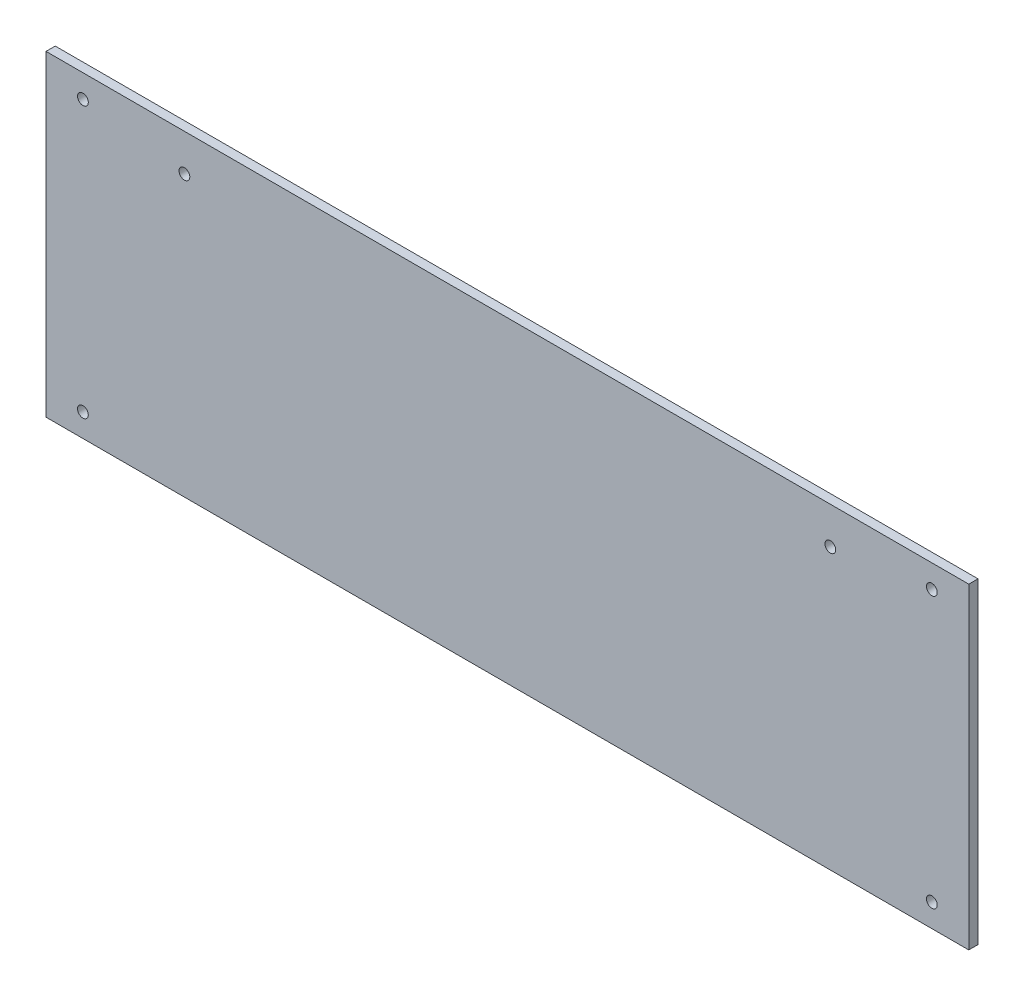
ISO-10303-21;
HEADER;
FILE_DESCRIPTION(('STEP AP214'),'2;1');
FILE_NAME('part.step','',(''),(''),'','','');
FILE_SCHEMA(('AUTOMOTIVE_DESIGN { 1 0 10303 214 1 1 1 1 }'));
ENDSEC;
DATA;
#1=APPLICATION_CONTEXT('core data for automotive mechanical design processes');
#2=APPLICATION_PROTOCOL_DEFINITION('international standard','automotive_design',2000,#1);
#3=PRODUCT_CONTEXT('',#1,'mechanical');
#4=PRODUCT('Part','Part','',(#3));
#5=PRODUCT_RELATED_PRODUCT_CATEGORY('part','',(#4));
#6=PRODUCT_DEFINITION_FORMATION('','',#4);
#7=PRODUCT_DEFINITION_CONTEXT('part definition',#1,'design');
#8=PRODUCT_DEFINITION('design','',#6,#7);
#9=PRODUCT_DEFINITION_SHAPE('','',#8);
#10=(LENGTH_UNIT() NAMED_UNIT(*) SI_UNIT(.MILLI.,.METRE.));
#11=(NAMED_UNIT(*) PLANE_ANGLE_UNIT() SI_UNIT($,.RADIAN.));
#12=(NAMED_UNIT(*) SI_UNIT($,.STERADIAN.) SOLID_ANGLE_UNIT());
#13=UNCERTAINTY_MEASURE_WITH_UNIT(LENGTH_MEASURE(1.E-05),#10,'distance_accuracy_value','');
#14=(GEOMETRIC_REPRESENTATION_CONTEXT(3) GLOBAL_UNCERTAINTY_ASSIGNED_CONTEXT((#13)) GLOBAL_UNIT_ASSIGNED_CONTEXT((#10,
#11,#12)) REPRESENTATION_CONTEXT('',''));
#15=CARTESIAN_POINT('',(0.,0.,0.));
#16=DIRECTION('',(0.,0.,1.));
#17=DIRECTION('',(1.,0.,0.));
#18=AXIS2_PLACEMENT_3D('',#15,#16,#17);
#19=CARTESIAN_POINT('',(0.,0.,3.));
#20=DIRECTION('',(0.,0.,-1.));
#21=DIRECTION('',(-1.,0.,0.));
#22=AXIS2_PLACEMENT_3D('',#19,#20,#21);
#23=PLANE('',#22);
#24=DIRECTION('',(1.,0.,0.));
#25=VECTOR('',#24,1.);
#26=CARTESIAN_POINT('',(0.,-3.,3.));
#27=LINE('',#26,#25);
#28=CARTESIAN_POINT('',(0.,-3.,3.));
#29=VERTEX_POINT('',#28);
#30=CARTESIAN_POINT('',(300.,-3.,3.));
#31=VERTEX_POINT('',#30);
#32=EDGE_CURVE('E289',#29,#31,#27,.T.);
#33=ORIENTED_EDGE('',*,*,#32,.T.);
#34=DIRECTION('',(0.,1.,0.));
#35=VECTOR('',#34,1.);
#36=CARTESIAN_POINT('',(300.,0.,3.));
#37=LINE('',#36,#35);
#38=CARTESIAN_POINT('',(300.,100.,3.));
#39=VERTEX_POINT('',#38);
#40=EDGE_CURVE('E57',#31,#39,#37,.T.);
#41=ORIENTED_EDGE('',*,*,#40,.T.);
#42=DIRECTION('',(1.,0.,0.));
#43=VECTOR('',#42,1.);
#44=CARTESIAN_POINT('',(0.,100.,3.));
#45=LINE('',#44,#43);
#46=CARTESIAN_POINT('',(0.,100.,3.));
#47=VERTEX_POINT('',#46);
#48=EDGE_CURVE('E59',#39,#47,#45,.F.);
#49=ORIENTED_EDGE('',*,*,#48,.T.);
#50=DIRECTION('',(0.,1.,0.));
#51=VECTOR('',#50,1.);
#52=CARTESIAN_POINT('',(0.,0.,3.));
#53=LINE('',#52,#51);
#54=EDGE_CURVE('E62',#47,#29,#53,.F.);
#55=ORIENTED_EDGE('',*,*,#54,.T.);
#56=EDGE_LOOP('',(#33,#41,#49,#55));
#57=FACE_BOUND('',#56,.T.);
#58=CARTESIAN_POINT('',(288.,92.5,3.));
#59=DIRECTION('',(0.,0.,-1.));
#60=DIRECTION('',(-1.,0.,0.));
#61=AXIS2_PLACEMENT_3D('',#58,#59,#60);
#62=CIRCLE('',#61,1.74999999999997);
#63=CARTESIAN_POINT('',(286.25,92.5,3.));
#64=VERTEX_POINT('',#63);
#65=EDGE_CURVE('E77',#64,#64,#62,.T.);
#66=ORIENTED_EDGE('',*,*,#65,.T.);
#67=EDGE_LOOP('',(#66));
#68=FACE_BOUND('',#67,.T.);
#69=CARTESIAN_POINT('',(12.,92.5,3.));
#70=DIRECTION('',(0.,0.,-1.));
#71=DIRECTION('',(-1.,0.,0.));
#72=AXIS2_PLACEMENT_3D('',#69,#70,#71);
#73=CIRCLE('',#72,1.74999999999998);
#74=CARTESIAN_POINT('',(10.25,92.5,3.));
#75=VERTEX_POINT('',#74);
#76=EDGE_CURVE('E119',#75,#75,#73,.T.);
#77=ORIENTED_EDGE('',*,*,#76,.T.);
#78=EDGE_LOOP('',(#77));
#79=FACE_BOUND('',#78,.T.);
#80=CARTESIAN_POINT('',(12.,4.50000000000003,3.));
#81=DIRECTION('',(0.,0.,-1.));
#82=DIRECTION('',(-1.,0.,0.));
#83=AXIS2_PLACEMENT_3D('',#80,#81,#82);
#84=CIRCLE('',#83,1.74999999999998);
#85=CARTESIAN_POINT('',(10.25,4.50000000000003,3.));
#86=VERTEX_POINT('',#85);
#87=EDGE_CURVE('E123',#86,#86,#84,.T.);
#88=ORIENTED_EDGE('',*,*,#87,.T.);
#89=EDGE_LOOP('',(#88));
#90=FACE_BOUND('',#89,.T.);
#91=CARTESIAN_POINT('',(288.,4.5,3.));
#92=DIRECTION('',(0.,0.,-1.));
#93=DIRECTION('',(-1.,0.,0.));
#94=AXIS2_PLACEMENT_3D('',#91,#92,#93);
#95=CIRCLE('',#94,1.74999999999997);
#96=CARTESIAN_POINT('',(286.25,4.5,3.));
#97=VERTEX_POINT('',#96);
#98=EDGE_CURVE('E127',#97,#97,#95,.T.);
#99=ORIENTED_EDGE('',*,*,#98,.T.);
#100=EDGE_LOOP('',(#99));
#101=FACE_BOUND('',#100,.T.);
#102=CARTESIAN_POINT('',(45.,88.,3.));
#103=DIRECTION('',(0.,0.,-1.));
#104=DIRECTION('',(-1.,0.,0.));
#105=AXIS2_PLACEMENT_3D('',#102,#103,#104);
#106=CIRCLE('',#105,1.75);
#107=CARTESIAN_POINT('',(43.25,88.,3.));
#108=VERTEX_POINT('',#107);
#109=EDGE_CURVE('E130',#108,#108,#106,.T.);
#110=ORIENTED_EDGE('',*,*,#109,.T.);
#111=EDGE_LOOP('',(#110));
#112=FACE_BOUND('',#111,.T.);
#113=CARTESIAN_POINT('',(255.,88.,3.));
#114=DIRECTION('',(0.,0.,-1.));
#115=DIRECTION('',(-1.,0.,0.));
#116=AXIS2_PLACEMENT_3D('',#113,#114,#115);
#117=CIRCLE('',#116,1.75000000000003);
#118=CARTESIAN_POINT('',(253.25,88.,3.));
#119=VERTEX_POINT('',#118);
#120=EDGE_CURVE('E21',#119,#119,#117,.T.);
#121=ORIENTED_EDGE('',*,*,#120,.T.);
#122=EDGE_LOOP('',(#121));
#123=FACE_BOUND('',#122,.T.);
#124=ADVANCED_FACE('F18',(#57,#68,#79,#90,#101,#112,#123),#23,.F.);
#125=CARTESIAN_POINT('',(255.,88.,3.));
#126=DIRECTION('',(0.,0.,-1.));
#127=DIRECTION('',(-1.,0.,0.));
#128=AXIS2_PLACEMENT_3D('',#125,#126,#127);
#129=CYLINDRICAL_SURFACE('',#128,1.75000000000003);
#130=CARTESIAN_POINT('',(255.,88.,0.));
#131=DIRECTION('',(0.,0.,-1.));
#132=DIRECTION('',(-1.,0.,0.));
#133=AXIS2_PLACEMENT_3D('',#130,#131,#132);
#134=CIRCLE('',#133,1.75000000000003);
#135=CARTESIAN_POINT('',(253.25,88.,0.));
#136=VERTEX_POINT('',#135);
#137=EDGE_CURVE('E112',#136,#136,#134,.F.);
#138=ORIENTED_EDGE('',*,*,#137,.F.);
#139=EDGE_LOOP('',(#138));
#140=FACE_BOUND('',#139,.T.);
#141=ORIENTED_EDGE('',*,*,#120,.F.);
#142=EDGE_LOOP('',(#141));
#143=FACE_BOUND('',#142,.T.);
#144=ADVANCED_FACE('F140',(#140,#143),#129,.F.);
#145=CARTESIAN_POINT('',(45.,88.,3.));
#146=DIRECTION('',(0.,0.,-1.));
#147=DIRECTION('',(-1.,0.,0.));
#148=AXIS2_PLACEMENT_3D('',#145,#146,#147);
#149=CYLINDRICAL_SURFACE('',#148,1.75);
#150=CARTESIAN_POINT('',(45.,88.,0.));
#151=DIRECTION('',(0.,0.,-1.));
#152=DIRECTION('',(-1.,0.,0.));
#153=AXIS2_PLACEMENT_3D('',#150,#151,#152);
#154=CIRCLE('',#153,1.75);
#155=CARTESIAN_POINT('',(43.25,88.,0.));
#156=VERTEX_POINT('',#155);
#157=EDGE_CURVE('E108',#156,#156,#154,.F.);
#158=ORIENTED_EDGE('',*,*,#157,.F.);
#159=EDGE_LOOP('',(#158));
#160=FACE_BOUND('',#159,.T.);
#161=ORIENTED_EDGE('',*,*,#109,.F.);
#162=EDGE_LOOP('',(#161));
#163=FACE_BOUND('',#162,.T.);
#164=ADVANCED_FACE('F142',(#160,#163),#149,.F.);
#165=CARTESIAN_POINT('',(288.,4.5,10.));
#166=DIRECTION('',(0.,0.,-1.));
#167=DIRECTION('',(-1.,0.,0.));
#168=AXIS2_PLACEMENT_3D('',#165,#166,#167);
#169=CYLINDRICAL_SURFACE('',#168,1.74999999999997);
#170=CARTESIAN_POINT('',(288.,4.5,0.));
#171=DIRECTION('',(0.,0.,-1.));
#172=DIRECTION('',(-1.,0.,0.));
#173=AXIS2_PLACEMENT_3D('',#170,#171,#172);
#174=CIRCLE('',#173,1.74999999999997);
#175=CARTESIAN_POINT('',(286.25,4.5,0.));
#176=VERTEX_POINT('',#175);
#177=EDGE_CURVE('E104',#176,#176,#174,.F.);
#178=ORIENTED_EDGE('',*,*,#177,.F.);
#179=EDGE_LOOP('',(#178));
#180=FACE_BOUND('',#179,.T.);
#181=ORIENTED_EDGE('',*,*,#98,.F.);
#182=EDGE_LOOP('',(#181));
#183=FACE_BOUND('',#182,.T.);
#184=ADVANCED_FACE('F149',(#180,#183),#169,.F.);
#185=CARTESIAN_POINT('',(12.,4.50000000000003,10.));
#186=DIRECTION('',(0.,0.,-1.));
#187=DIRECTION('',(-1.,0.,0.));
#188=AXIS2_PLACEMENT_3D('',#185,#186,#187);
#189=CYLINDRICAL_SURFACE('',#188,1.74999999999998);
#190=CARTESIAN_POINT('',(12.,4.50000000000003,0.));
#191=DIRECTION('',(0.,0.,-1.));
#192=DIRECTION('',(-1.,0.,0.));
#193=AXIS2_PLACEMENT_3D('',#190,#191,#192);
#194=CIRCLE('',#193,1.74999999999998);
#195=CARTESIAN_POINT('',(10.25,4.50000000000003,0.));
#196=VERTEX_POINT('',#195);
#197=EDGE_CURVE('E100',#196,#196,#194,.F.);
#198=ORIENTED_EDGE('',*,*,#197,.F.);
#199=EDGE_LOOP('',(#198));
#200=FACE_BOUND('',#199,.T.);
#201=ORIENTED_EDGE('',*,*,#87,.F.);
#202=EDGE_LOOP('',(#201));
#203=FACE_BOUND('',#202,.T.);
#204=ADVANCED_FACE('F180',(#200,#203),#189,.F.);
#205=CARTESIAN_POINT('',(12.,92.5,10.));
#206=DIRECTION('',(0.,0.,-1.));
#207=DIRECTION('',(-1.,0.,0.));
#208=AXIS2_PLACEMENT_3D('',#205,#206,#207);
#209=CYLINDRICAL_SURFACE('',#208,1.74999999999998);
#210=CARTESIAN_POINT('',(12.,92.5,0.));
#211=DIRECTION('',(0.,0.,-1.));
#212=DIRECTION('',(-1.,0.,0.));
#213=AXIS2_PLACEMENT_3D('',#210,#211,#212);
#214=CIRCLE('',#213,1.74999999999998);
#215=CARTESIAN_POINT('',(10.25,92.5,0.));
#216=VERTEX_POINT('',#215);
#217=EDGE_CURVE('E96',#216,#216,#214,.F.);
#218=ORIENTED_EDGE('',*,*,#217,.F.);
#219=EDGE_LOOP('',(#218));
#220=FACE_BOUND('',#219,.T.);
#221=ORIENTED_EDGE('',*,*,#76,.F.);
#222=EDGE_LOOP('',(#221));
#223=FACE_BOUND('',#222,.T.);
#224=ADVANCED_FACE('F176',(#220,#223),#209,.F.);
#225=CARTESIAN_POINT('',(288.,92.5,10.));
#226=DIRECTION('',(0.,0.,-1.));
#227=DIRECTION('',(-1.,0.,0.));
#228=AXIS2_PLACEMENT_3D('',#225,#226,#227);
#229=CYLINDRICAL_SURFACE('',#228,1.74999999999997);
#230=CARTESIAN_POINT('',(288.,92.5,0.));
#231=DIRECTION('',(0.,0.,-1.));
#232=DIRECTION('',(-1.,0.,0.));
#233=AXIS2_PLACEMENT_3D('',#230,#231,#232);
#234=CIRCLE('',#233,1.74999999999997);
#235=CARTESIAN_POINT('',(286.25,92.5,0.));
#236=VERTEX_POINT('',#235);
#237=EDGE_CURVE('E91',#236,#236,#234,.F.);
#238=ORIENTED_EDGE('',*,*,#237,.F.);
#239=EDGE_LOOP('',(#238));
#240=FACE_BOUND('',#239,.T.);
#241=ORIENTED_EDGE('',*,*,#65,.F.);
#242=EDGE_LOOP('',(#241));
#243=FACE_BOUND('',#242,.T.);
#244=ADVANCED_FACE('F173',(#240,#243),#229,.F.);
#245=CARTESIAN_POINT('',(0.,0.,3.));
#246=DIRECTION('',(1.,0.,0.));
#247=DIRECTION('',(0.,0.,-1.));
#248=AXIS2_PLACEMENT_3D('',#245,#246,#247);
#249=PLANE('',#248);
#250=DIRECTION('',(0.,0.,1.));
#251=VECTOR('',#250,1.);
#252=CARTESIAN_POINT('',(0.,-3.,0.));
#253=LINE('',#252,#251);
#254=CARTESIAN_POINT('',(0.,-3.,0.));
#255=VERTEX_POINT('',#254);
#256=EDGE_CURVE('E74',#255,#29,#253,.T.);
#257=ORIENTED_EDGE('',*,*,#256,.T.);
#258=ORIENTED_EDGE('',*,*,#54,.F.);
#259=DIRECTION('',(0.,0.,-1.));
#260=VECTOR('',#259,1.);
#261=CARTESIAN_POINT('',(0.,100.,3.));
#262=LINE('',#261,#260);
#263=CARTESIAN_POINT('',(0.,100.,0.));
#264=VERTEX_POINT('',#263);
#265=EDGE_CURVE('E68',#47,#264,#262,.T.);
#266=ORIENTED_EDGE('',*,*,#265,.T.);
#267=DIRECTION('',(0.,1.,0.));
#268=VECTOR('',#267,1.);
#269=CARTESIAN_POINT('',(0.,0.,0.));
#270=LINE('',#269,#268);
#271=EDGE_CURVE('E95',#255,#264,#270,.T.);
#272=ORIENTED_EDGE('',*,*,#271,.F.);
#273=EDGE_LOOP('',(#257,#258,#266,#272));
#274=FACE_BOUND('',#273,.T.);
#275=ADVANCED_FACE('F71',(#274),#249,.F.);
#276=CARTESIAN_POINT('',(0.,100.,3.));
#277=DIRECTION('',(0.,-1.,0.));
#278=DIRECTION('',(0.,0.,-1.));
#279=AXIS2_PLACEMENT_3D('',#276,#277,#278);
#280=PLANE('',#279);
#281=ORIENTED_EDGE('',*,*,#265,.F.);
#282=ORIENTED_EDGE('',*,*,#48,.F.);
#283=DIRECTION('',(0.,0.,1.));
#284=VECTOR('',#283,1.);
#285=CARTESIAN_POINT('',(300.,100.,3.));
#286=LINE('',#285,#284);
#287=CARTESIAN_POINT('',(300.,100.,0.));
#288=VERTEX_POINT('',#287);
#289=EDGE_CURVE('E87',#39,#288,#286,.F.);
#290=ORIENTED_EDGE('',*,*,#289,.T.);
#291=DIRECTION('',(-1.,0.,0.));
#292=VECTOR('',#291,1.);
#293=CARTESIAN_POINT('',(0.,100.,0.));
#294=LINE('',#293,#292);
#295=EDGE_CURVE('E81',#264,#288,#294,.F.);
#296=ORIENTED_EDGE('',*,*,#295,.F.);
#297=EDGE_LOOP('',(#281,#282,#290,#296));
#298=FACE_BOUND('',#297,.T.);
#299=ADVANCED_FACE('F79',(#298),#280,.F.);
#300=CARTESIAN_POINT('',(300.,0.,3.));
#301=DIRECTION('',(-1.,0.,0.));
#302=DIRECTION('',(0.,0.,1.));
#303=AXIS2_PLACEMENT_3D('',#300,#301,#302);
#304=PLANE('',#303);
#305=ORIENTED_EDGE('',*,*,#289,.F.);
#306=ORIENTED_EDGE('',*,*,#40,.F.);
#307=DIRECTION('',(0.,0.,1.));
#308=VECTOR('',#307,1.);
#309=CARTESIAN_POINT('',(300.,-3.,0.));
#310=LINE('',#309,#308);
#311=CARTESIAN_POINT('',(300.,-3.,0.));
#312=VERTEX_POINT('',#311);
#313=EDGE_CURVE('E37',#31,#312,#310,.F.);
#314=ORIENTED_EDGE('',*,*,#313,.T.);
#315=DIRECTION('',(0.,1.,0.));
#316=VECTOR('',#315,1.);
#317=CARTESIAN_POINT('',(300.,0.,0.));
#318=LINE('',#317,#316);
#319=EDGE_CURVE('E28',#288,#312,#318,.F.);
#320=ORIENTED_EDGE('',*,*,#319,.F.);
#321=EDGE_LOOP('',(#305,#306,#314,#320));
#322=FACE_BOUND('',#321,.T.);
#323=ADVANCED_FACE('F161',(#322),#304,.F.);
#324=CARTESIAN_POINT('',(0.,-3.,0.));
#325=DIRECTION('',(0.,1.,0.));
#326=DIRECTION('',(0.,0.,1.));
#327=AXIS2_PLACEMENT_3D('',#324,#325,#326);
#328=PLANE('',#327);
#329=ORIENTED_EDGE('',*,*,#32,.F.);
#330=ORIENTED_EDGE('',*,*,#256,.F.);
#331=DIRECTION('',(-1.,0.,0.));
#332=VECTOR('',#331,1.);
#333=CARTESIAN_POINT('',(0.,-3.,0.));
#334=LINE('',#333,#332);
#335=EDGE_CURVE('E11',#312,#255,#334,.T.);
#336=ORIENTED_EDGE('',*,*,#335,.F.);
#337=ORIENTED_EDGE('',*,*,#313,.F.);
#338=EDGE_LOOP('',(#329,#330,#336,#337));
#339=FACE_BOUND('',#338,.T.);
#340=ADVANCED_FACE('F155',(#339),#328,.F.);
#341=CARTESIAN_POINT('',(0.,0.,0.));
#342=DIRECTION('',(0.,0.,-1.));
#343=DIRECTION('',(-1.,0.,0.));
#344=AXIS2_PLACEMENT_3D('',#341,#342,#343);
#345=PLANE('',#344);
#346=ORIENTED_EDGE('',*,*,#319,.T.);
#347=ORIENTED_EDGE('',*,*,#335,.T.);
#348=ORIENTED_EDGE('',*,*,#271,.T.);
#349=ORIENTED_EDGE('',*,*,#295,.T.);
#350=EDGE_LOOP('',(#346,#347,#348,#349));
#351=FACE_BOUND('',#350,.T.);
#352=ORIENTED_EDGE('',*,*,#237,.T.);
#353=EDGE_LOOP('',(#352));
#354=FACE_BOUND('',#353,.T.);
#355=ORIENTED_EDGE('',*,*,#217,.T.);
#356=EDGE_LOOP('',(#355));
#357=FACE_BOUND('',#356,.T.);
#358=ORIENTED_EDGE('',*,*,#197,.T.);
#359=EDGE_LOOP('',(#358));
#360=FACE_BOUND('',#359,.T.);
#361=ORIENTED_EDGE('',*,*,#177,.T.);
#362=EDGE_LOOP('',(#361));
#363=FACE_BOUND('',#362,.T.);
#364=ORIENTED_EDGE('',*,*,#157,.T.);
#365=EDGE_LOOP('',(#364));
#366=FACE_BOUND('',#365,.T.);
#367=ORIENTED_EDGE('',*,*,#137,.T.);
#368=EDGE_LOOP('',(#367));
#369=FACE_BOUND('',#368,.T.);
#370=ADVANCED_FACE('F153',(#351,#354,#357,#360,#363,#366,#369),#345,.T.);
#371=CLOSED_SHELL('',(#124,#144,#164,#184,#204,#224,#244,#275,#299,#323,#340,#370));
#372=MANIFOLD_SOLID_BREP('B1',#371);
#373=ADVANCED_BREP_SHAPE_REPRESENTATION('',(#18,#372),#14);
#374=SHAPE_DEFINITION_REPRESENTATION(#9,#373);
ENDSEC;
END-ISO-10303-21;
